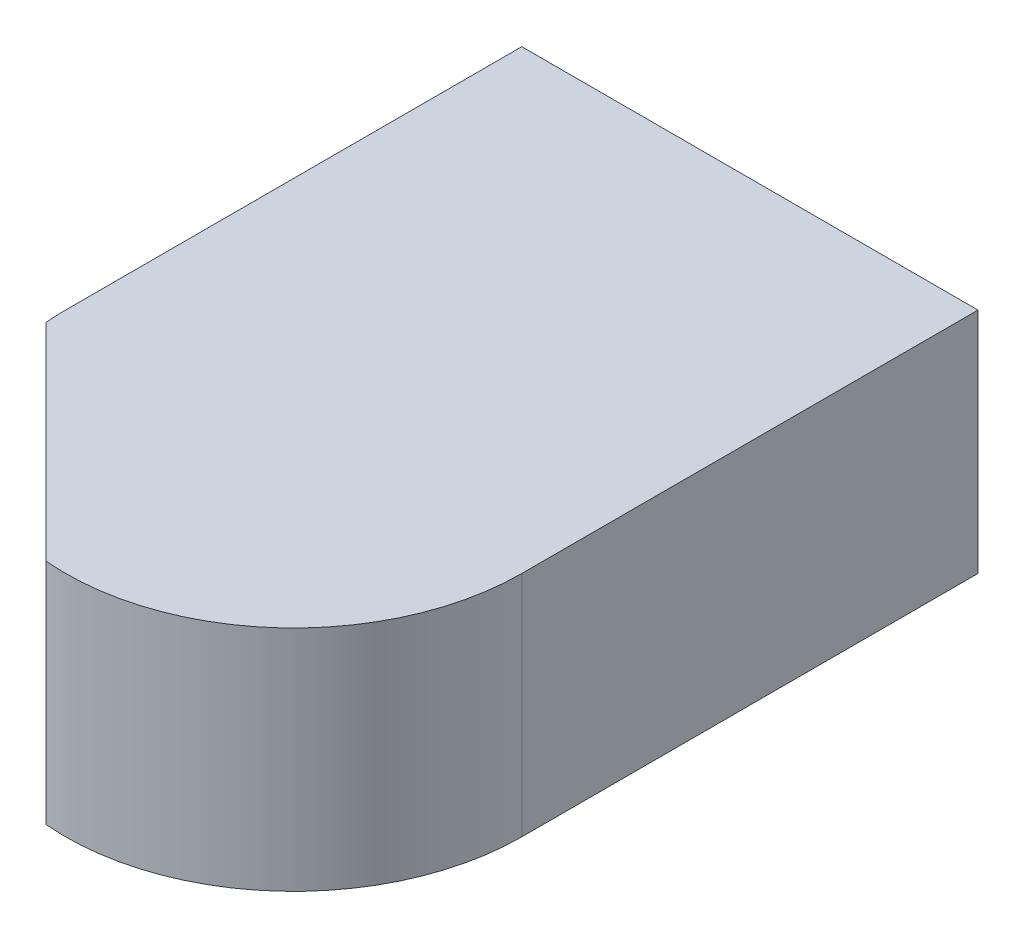
ISO-10303-21;
HEADER;
FILE_DESCRIPTION(('STEP AP214'),'2;1');
FILE_NAME('part.step','',(''),(''),'','','');
FILE_SCHEMA(('AUTOMOTIVE_DESIGN { 1 0 10303 214 1 1 1 1 }'));
ENDSEC;
DATA;
#1=APPLICATION_CONTEXT('core data for automotive mechanical design processes');
#2=APPLICATION_PROTOCOL_DEFINITION('international standard','automotive_design',2000,#1);
#3=PRODUCT_CONTEXT('',#1,'mechanical');
#4=PRODUCT('Part','Part','',(#3));
#5=PRODUCT_RELATED_PRODUCT_CATEGORY('part','',(#4));
#6=PRODUCT_DEFINITION_FORMATION('','',#4);
#7=PRODUCT_DEFINITION_CONTEXT('part definition',#1,'design');
#8=PRODUCT_DEFINITION('design','',#6,#7);
#9=PRODUCT_DEFINITION_SHAPE('','',#8);
#10=(LENGTH_UNIT() NAMED_UNIT(*) SI_UNIT(.MILLI.,.METRE.));
#11=(NAMED_UNIT(*) PLANE_ANGLE_UNIT() SI_UNIT($,.RADIAN.));
#12=(NAMED_UNIT(*) SI_UNIT($,.STERADIAN.) SOLID_ANGLE_UNIT());
#13=UNCERTAINTY_MEASURE_WITH_UNIT(LENGTH_MEASURE(1.E-05),#10,'distance_accuracy_value','');
#14=(GEOMETRIC_REPRESENTATION_CONTEXT(3) GLOBAL_UNCERTAINTY_ASSIGNED_CONTEXT((#13)) GLOBAL_UNIT_ASSIGNED_CONTEXT((#10,
#11,#12)) REPRESENTATION_CONTEXT('',''));
#15=CARTESIAN_POINT('',(0.,0.,0.));
#16=DIRECTION('',(0.,0.,1.));
#17=DIRECTION('',(1.,0.,0.));
#18=AXIS2_PLACEMENT_3D('',#15,#16,#17);
#19=CARTESIAN_POINT('',(0.,0.,0.));
#20=DIRECTION('',(0.,1.,0.));
#21=DIRECTION('',(1.,0.,0.));
#22=AXIS2_PLACEMENT_3D('',#19,#20,#21);
#23=PLANE('',#22);
#24=CARTESIAN_POINT('',(-0.8,0.,-2.05));
#25=DIRECTION('',(0.,1.,0.));
#26=DIRECTION('',(-1.,0.,0.));
#27=AXIS2_PLACEMENT_3D('',#24,#25,#26);
#28=CIRCLE('',#27,0.1);
#29=CARTESIAN_POINT('',(-0.9,0.,-2.05));
#30=VERTEX_POINT('',#29);
#31=CARTESIAN_POINT('',(-0.899595718004,0.,-2.041017074242));
#32=VERTEX_POINT('',#31);
#33=EDGE_CURVE('E11',#30,#32,#28,.T.);
#34=ORIENTED_EDGE('',*,*,#33,.F.);
#35=DIRECTION('',(0.,0.,1.));
#36=VECTOR('',#35,1.);
#37=CARTESIAN_POINT('',(-0.9,0.,-2.25));
#38=LINE('',#37,#36);
#39=CARTESIAN_POINT('',(-0.9,0.,-2.25));
#40=VERTEX_POINT('',#39);
#41=EDGE_CURVE('E25',#40,#30,#38,.T.);
#42=ORIENTED_EDGE('',*,*,#41,.F.);
#43=DIRECTION('',(-1.,0.,0.));
#44=VECTOR('',#43,1.);
#45=CARTESIAN_POINT('',(-0.7,0.,-2.25));
#46=LINE('',#45,#44);
#47=CARTESIAN_POINT('',(-0.7,0.,-2.25));
#48=VERTEX_POINT('',#47);
#49=EDGE_CURVE('E146',#48,#40,#46,.T.);
#50=ORIENTED_EDGE('',*,*,#49,.F.);
#51=DIRECTION('',(0.,0.,-1.));
#52=VECTOR('',#51,1.);
#53=CARTESIAN_POINT('',(-0.7,0.,-2.05));
#54=LINE('',#53,#52);
#55=CARTESIAN_POINT('',(-0.7,0.,-2.05));
#56=VERTEX_POINT('',#55);
#57=EDGE_CURVE('E142',#56,#48,#54,.T.);
#58=ORIENTED_EDGE('',*,*,#57,.F.);
#59=CARTESIAN_POINT('',(-0.8,0.,-2.05));
#60=DIRECTION('',(0.,1.,0.));
#61=DIRECTION('',(-0.0898292575823554,0.,0.995957180044505));
#62=AXIS2_PLACEMENT_3D('',#59,#60,#61);
#63=CIRCLE('',#62,0.1);
#64=CARTESIAN_POINT('',(-0.808982925758,0.,-1.950404281996));
#65=VERTEX_POINT('',#64);
#66=EDGE_CURVE('E89',#65,#56,#63,.T.);
#67=ORIENTED_EDGE('',*,*,#66,.F.);
#68=DIRECTION('',(0.707106781186548,0.,0.707106781186548));
#69=VECTOR('',#68,1.);
#70=CARTESIAN_POINT('',(-0.899595718004,0.,-2.041017074242));
#71=LINE('',#70,#69);
#72=EDGE_CURVE('E134',#32,#65,#71,.T.);
#73=ORIENTED_EDGE('',*,*,#72,.F.);
#74=EDGE_LOOP('',(#34,#42,#50,#58,#67,#73));
#75=FACE_BOUND('',#74,.T.);
#76=ADVANCED_FACE('F17',(#75),#23,.F.);
#77=CARTESIAN_POINT('',(-0.899595718005,-0.02,-2.041017074242));
#78=DIRECTION('',(-0.707106781186548,0.,0.707106781186548));
#79=DIRECTION('',(0.707106781186548,0.,0.707106781186548));
#80=AXIS2_PLACEMENT_3D('',#77,#78,#79);
#81=PLANE('',#80);
#82=DIRECTION('',(0.,1.,0.));
#83=VECTOR('',#82,1.);
#84=CARTESIAN_POINT('',(-0.808982925758,0.,-1.950404281996));
#85=LINE('',#84,#83);
#86=CARTESIAN_POINT('',(-0.808982925758,0.1,-1.950404281996));
#87=VERTEX_POINT('',#86);
#88=EDGE_CURVE('E130',#65,#87,#85,.T.);
#89=ORIENTED_EDGE('',*,*,#88,.T.);
#90=DIRECTION('',(0.707106781186548,0.,0.707106781186548));
#91=VECTOR('',#90,1.);
#92=CARTESIAN_POINT('',(-0.899595718005,0.1,-2.041017074242));
#93=LINE('',#92,#91);
#94=CARTESIAN_POINT('',(-0.899595718005,0.1,-2.041017074242));
#95=VERTEX_POINT('',#94);
#96=EDGE_CURVE('E84',#95,#87,#93,.T.);
#97=ORIENTED_EDGE('',*,*,#96,.F.);
#98=DIRECTION('',(0.,1.,0.));
#99=VECTOR('',#98,1.);
#100=CARTESIAN_POINT('',(-0.899595718005,0.,-2.041017074242));
#101=LINE('',#100,#99);
#102=EDGE_CURVE('E122',#32,#95,#101,.T.);
#103=ORIENTED_EDGE('',*,*,#102,.F.);
#104=ORIENTED_EDGE('',*,*,#72,.T.);
#105=EDGE_LOOP('',(#89,#97,#103,#104));
#106=FACE_BOUND('',#105,.T.);
#107=ADVANCED_FACE('F161',(#106),#81,.T.);
#108=CARTESIAN_POINT('',(-0.8,0.,-2.05));
#109=DIRECTION('',(0.,1.,0.));
#110=DIRECTION('',(0.99898878373202,0.,-0.0449600931673826));
#111=AXIS2_PLACEMENT_3D('',#108,#109,#110);
#112=CYLINDRICAL_SURFACE('',#111,0.1);
#113=CARTESIAN_POINT('',(-0.8,0.1,-2.05));
#114=DIRECTION('',(0.,1.,0.));
#115=DIRECTION('',(-1.,0.,0.));
#116=AXIS2_PLACEMENT_3D('',#113,#114,#115);
#117=CIRCLE('',#116,0.1);
#118=CARTESIAN_POINT('',(-0.9,0.1,-2.05));
#119=VERTEX_POINT('',#118);
#120=EDGE_CURVE('E118',#119,#95,#117,.T.);
#121=ORIENTED_EDGE('',*,*,#120,.F.);
#122=DIRECTION('',(0.,1.,0.));
#123=VECTOR('',#122,1.);
#124=CARTESIAN_POINT('',(-0.9,0.,-2.05));
#125=LINE('',#124,#123);
#126=EDGE_CURVE('E113',#30,#119,#125,.T.);
#127=ORIENTED_EDGE('',*,*,#126,.F.);
#128=ORIENTED_EDGE('',*,*,#33,.T.);
#129=ORIENTED_EDGE('',*,*,#102,.T.);
#130=EDGE_LOOP('',(#121,#127,#128,#129));
#131=FACE_BOUND('',#130,.T.);
#132=ADVANCED_FACE('F163',(#131),#112,.T.);
#133=CARTESIAN_POINT('',(-0.9,0.,-2.25));
#134=DIRECTION('',(-1.,0.,0.));
#135=DIRECTION('',(0.,0.,1.));
#136=AXIS2_PLACEMENT_3D('',#133,#134,#135);
#137=PLANE('',#136);
#138=ORIENTED_EDGE('',*,*,#126,.T.);
#139=DIRECTION('',(0.,0.,1.));
#140=VECTOR('',#139,1.);
#141=CARTESIAN_POINT('',(-0.9,0.1,-2.25));
#142=LINE('',#141,#140);
#143=CARTESIAN_POINT('',(-0.9,0.1,-2.25));
#144=VERTEX_POINT('',#143);
#145=EDGE_CURVE('E108',#144,#119,#142,.T.);
#146=ORIENTED_EDGE('',*,*,#145,.F.);
#147=DIRECTION('',(0.,1.,0.));
#148=VECTOR('',#147,1.);
#149=CARTESIAN_POINT('',(-0.9,0.,-2.25));
#150=LINE('',#149,#148);
#151=EDGE_CURVE('E103',#40,#144,#150,.T.);
#152=ORIENTED_EDGE('',*,*,#151,.F.);
#153=ORIENTED_EDGE('',*,*,#41,.T.);
#154=EDGE_LOOP('',(#138,#146,#152,#153));
#155=FACE_BOUND('',#154,.T.);
#156=ADVANCED_FACE('F156',(#155),#137,.T.);
#157=CARTESIAN_POINT('',(-0.7,0.,-2.25));
#158=DIRECTION('',(0.,0.,-1.));
#159=DIRECTION('',(-1.,0.,0.));
#160=AXIS2_PLACEMENT_3D('',#157,#158,#159);
#161=PLANE('',#160);
#162=ORIENTED_EDGE('',*,*,#151,.T.);
#163=DIRECTION('',(-1.,0.,0.));
#164=VECTOR('',#163,1.);
#165=CARTESIAN_POINT('',(-0.7,0.1,-2.25));
#166=LINE('',#165,#164);
#167=CARTESIAN_POINT('',(-0.7,0.1,-2.25));
#168=VERTEX_POINT('',#167);
#169=EDGE_CURVE('E99',#168,#144,#166,.T.);
#170=ORIENTED_EDGE('',*,*,#169,.F.);
#171=DIRECTION('',(0.,1.,0.));
#172=VECTOR('',#171,1.);
#173=CARTESIAN_POINT('',(-0.7,0.,-2.25));
#174=LINE('',#173,#172);
#175=EDGE_CURVE('E75',#48,#168,#174,.T.);
#176=ORIENTED_EDGE('',*,*,#175,.F.);
#177=ORIENTED_EDGE('',*,*,#49,.T.);
#178=EDGE_LOOP('',(#162,#170,#176,#177));
#179=FACE_BOUND('',#178,.T.);
#180=ADVANCED_FACE('F158',(#179),#161,.T.);
#181=CARTESIAN_POINT('',(-0.7,0.,-2.05));
#182=DIRECTION('',(1.,0.,0.));
#183=DIRECTION('',(0.,0.,-1.));
#184=AXIS2_PLACEMENT_3D('',#181,#182,#183);
#185=PLANE('',#184);
#186=ORIENTED_EDGE('',*,*,#175,.T.);
#187=DIRECTION('',(0.,0.,-1.));
#188=VECTOR('',#187,1.);
#189=CARTESIAN_POINT('',(-0.7,0.1,-2.05));
#190=LINE('',#189,#188);
#191=CARTESIAN_POINT('',(-0.7,0.1,-2.05));
#192=VERTEX_POINT('',#191);
#193=EDGE_CURVE('E67',#192,#168,#190,.T.);
#194=ORIENTED_EDGE('',*,*,#193,.F.);
#195=DIRECTION('',(0.,1.,0.));
#196=VECTOR('',#195,1.);
#197=CARTESIAN_POINT('',(-0.7,0.,-2.05));
#198=LINE('',#197,#196);
#199=EDGE_CURVE('E72',#56,#192,#198,.T.);
#200=ORIENTED_EDGE('',*,*,#199,.F.);
#201=ORIENTED_EDGE('',*,*,#57,.T.);
#202=EDGE_LOOP('',(#186,#194,#200,#201));
#203=FACE_BOUND('',#202,.T.);
#204=ADVANCED_FACE('F69',(#203),#185,.T.);
#205=CARTESIAN_POINT('',(-0.8,0.,-2.05));
#206=DIRECTION('',(0.,1.,0.));
#207=DIRECTION('',(-0.674600156543728,0.,-0.738183330068607));
#208=AXIS2_PLACEMENT_3D('',#205,#206,#207);
#209=CYLINDRICAL_SURFACE('',#208,0.1);
#210=ORIENTED_EDGE('',*,*,#66,.T.);
#211=ORIENTED_EDGE('',*,*,#199,.T.);
#212=CARTESIAN_POINT('',(-0.8,0.1,-2.05));
#213=DIRECTION('',(0.,1.,0.));
#214=DIRECTION('',(-0.0898292575823554,0.,0.995957180044505));
#215=AXIS2_PLACEMENT_3D('',#212,#213,#214);
#216=CIRCLE('',#215,0.1);
#217=EDGE_CURVE('E81',#87,#192,#216,.T.);
#218=ORIENTED_EDGE('',*,*,#217,.F.);
#219=ORIENTED_EDGE('',*,*,#88,.F.);
#220=EDGE_LOOP('',(#210,#211,#218,#219));
#221=FACE_BOUND('',#220,.T.);
#222=ADVANCED_FACE('F88',(#221),#209,.T.);
#223=CARTESIAN_POINT('',(0.,0.1,0.));
#224=DIRECTION('',(0.,1.,0.));
#225=DIRECTION('',(1.,0.,0.));
#226=AXIS2_PLACEMENT_3D('',#223,#224,#225);
#227=PLANE('',#226);
#228=ORIENTED_EDGE('',*,*,#217,.T.);
#229=ORIENTED_EDGE('',*,*,#193,.T.);
#230=ORIENTED_EDGE('',*,*,#169,.T.);
#231=ORIENTED_EDGE('',*,*,#145,.T.);
#232=ORIENTED_EDGE('',*,*,#120,.T.);
#233=ORIENTED_EDGE('',*,*,#96,.T.);
#234=EDGE_LOOP('',(#228,#229,#230,#231,#232,#233));
#235=FACE_BOUND('',#234,.T.);
#236=ADVANCED_FACE('F82',(#235),#227,.T.);
#237=CLOSED_SHELL('',(#76,#107,#132,#156,#180,#204,#222,#236));
#238=MANIFOLD_SOLID_BREP('B1',#237);
#239=ADVANCED_BREP_SHAPE_REPRESENTATION('',(#18,#238),#14);
#240=SHAPE_DEFINITION_REPRESENTATION(#9,#239);
ENDSEC;
END-ISO-10303-21;
